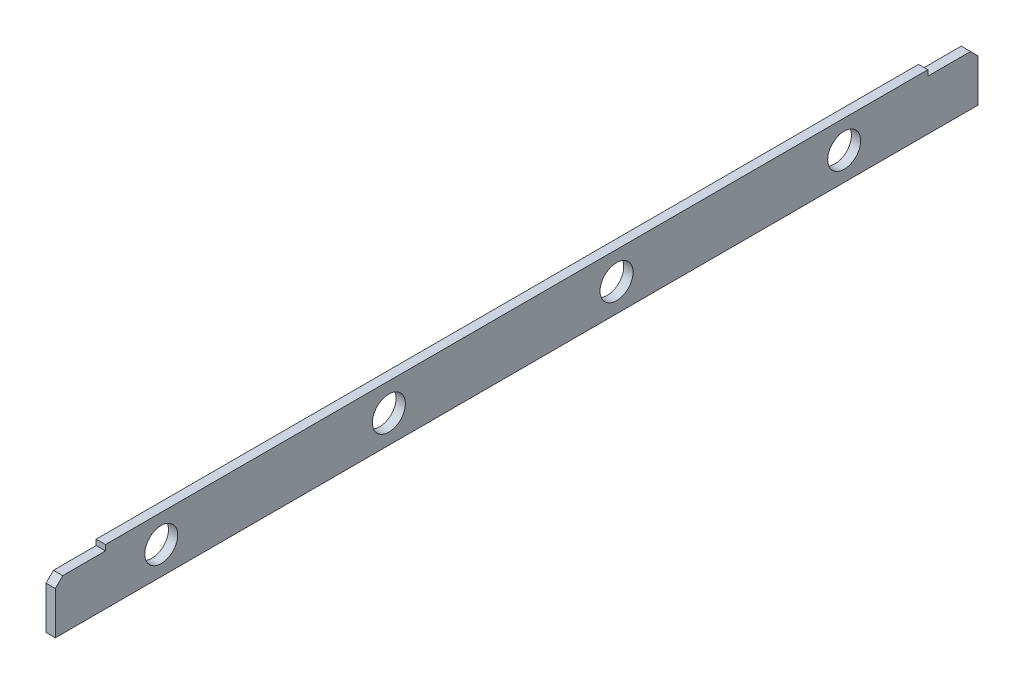
ISO-10303-21;
HEADER;
FILE_DESCRIPTION(('STEP AP214'),'2;1');
FILE_NAME('part.step','',(''),(''),'','','');
FILE_SCHEMA(('AUTOMOTIVE_DESIGN { 1 0 10303 214 1 1 1 1 }'));
ENDSEC;
DATA;
#1=APPLICATION_CONTEXT('core data for automotive mechanical design processes');
#2=APPLICATION_PROTOCOL_DEFINITION('international standard','automotive_design',2000,#1);
#3=PRODUCT_CONTEXT('',#1,'mechanical');
#4=PRODUCT('Part','Part','',(#3));
#5=PRODUCT_RELATED_PRODUCT_CATEGORY('part','',(#4));
#6=PRODUCT_DEFINITION_FORMATION('','',#4);
#7=PRODUCT_DEFINITION_CONTEXT('part definition',#1,'design');
#8=PRODUCT_DEFINITION('design','',#6,#7);
#9=PRODUCT_DEFINITION_SHAPE('','',#8);
#10=(LENGTH_UNIT() NAMED_UNIT(*) SI_UNIT(.MILLI.,.METRE.));
#11=(NAMED_UNIT(*) PLANE_ANGLE_UNIT() SI_UNIT($,.RADIAN.));
#12=(NAMED_UNIT(*) SI_UNIT($,.STERADIAN.) SOLID_ANGLE_UNIT());
#13=UNCERTAINTY_MEASURE_WITH_UNIT(LENGTH_MEASURE(1.E-05),#10,'distance_accuracy_value','');
#14=(GEOMETRIC_REPRESENTATION_CONTEXT(3) GLOBAL_UNCERTAINTY_ASSIGNED_CONTEXT((#13)) GLOBAL_UNIT_ASSIGNED_CONTEXT((#10,
#11,#12)) REPRESENTATION_CONTEXT('',''));
#15=CARTESIAN_POINT('',(0.,0.,0.));
#16=DIRECTION('',(0.,0.,1.));
#17=DIRECTION('',(1.,0.,0.));
#18=AXIS2_PLACEMENT_3D('',#15,#16,#17);
#19=CARTESIAN_POINT('',(-4.99999999999989,-60.000000000001,502.499999999999));
#20=DIRECTION('',(1.,0.,0.));
#21=DIRECTION('',(0.,0.,-1.));
#22=AXIS2_PLACEMENT_3D('',#19,#20,#21);
#23=PLANE('',#22);
#24=CARTESIAN_POINT('',(-4.99999999999989,-30.0000000000042,382.5));
#25=DIRECTION('',(1.,0.,0.));
#26=DIRECTION('',(0.,0.,-1.));
#27=AXIS2_PLACEMENT_3D('',#24,#25,#26);
#28=CIRCLE('',#27,17.75);
#29=CARTESIAN_POINT('',(-4.9999999999999,-30.0000000000042,364.75));
#30=VERTEX_POINT('',#29);
#31=EDGE_CURVE('E166',#30,#30,#28,.T.);
#32=ORIENTED_EDGE('',*,*,#31,.T.);
#33=EDGE_LOOP('',(#32));
#34=FACE_BOUND('',#33,.T.);
#35=CARTESIAN_POINT('',(-4.99999999999989,-30.0000000000042,137.5));
#36=DIRECTION('',(1.,0.,0.));
#37=DIRECTION('',(0.,0.,-1.));
#38=AXIS2_PLACEMENT_3D('',#35,#36,#37);
#39=CIRCLE('',#38,17.75);
#40=CARTESIAN_POINT('',(-4.9999999999999,-30.0000000000042,119.75));
#41=VERTEX_POINT('',#40);
#42=EDGE_CURVE('E163',#41,#41,#39,.T.);
#43=ORIENTED_EDGE('',*,*,#42,.T.);
#44=EDGE_LOOP('',(#43));
#45=FACE_BOUND('',#44,.T.);
#46=CARTESIAN_POINT('',(-5.,-30.0000000000042,-107.5));
#47=DIRECTION('',(1.,0.,0.));
#48=DIRECTION('',(0.,0.,-1.));
#49=AXIS2_PLACEMENT_3D('',#46,#47,#48);
#50=CIRCLE('',#49,17.75);
#51=CARTESIAN_POINT('',(-5.00000000000001,-30.0000000000042,-125.25));
#52=VERTEX_POINT('',#51);
#53=EDGE_CURVE('E160',#52,#52,#50,.T.);
#54=ORIENTED_EDGE('',*,*,#53,.T.);
#55=EDGE_LOOP('',(#54));
#56=FACE_BOUND('',#55,.T.);
#57=CARTESIAN_POINT('',(-5.,-30.0000000000042,-352.5));
#58=DIRECTION('',(1.,0.,0.));
#59=DIRECTION('',(0.,0.,-1.));
#60=AXIS2_PLACEMENT_3D('',#57,#58,#59);
#61=CIRCLE('',#60,17.75);
#62=CARTESIAN_POINT('',(-5.00000000000001,-30.0000000000042,-370.25));
#63=VERTEX_POINT('',#62);
#64=EDGE_CURVE('E159',#63,#63,#61,.T.);
#65=ORIENTED_EDGE('',*,*,#64,.T.);
#66=EDGE_LOOP('',(#65));
#67=FACE_BOUND('',#66,.T.);
#68=DIRECTION('',(0.,1.,0.));
#69=VECTOR('',#68,1.);
#70=CARTESIAN_POINT('',(-5.,-60.0000000000115,-496.5));
#71=LINE('',#70,#69);
#72=CARTESIAN_POINT('',(-5.00000000000334,-59.9999999999996,-496.5));
#73=VERTEX_POINT('',#72);
#74=CARTESIAN_POINT('',(-5.,-13.9999999999999,-496.5));
#75=VERTEX_POINT('',#74);
#76=EDGE_CURVE('E121',#73,#75,#71,.T.);
#77=ORIENTED_EDGE('',*,*,#76,.F.);
#78=DIRECTION('',(0.,0.,-1.));
#79=VECTOR('',#78,1.);
#80=CARTESIAN_POINT('',(-4.99999999999989,-60.000000000001,502.499999999999));
#81=LINE('',#80,#79);
#82=CARTESIAN_POINT('',(-4.99999999999989,-60.0000000000001,496.5));
#83=VERTEX_POINT('',#82);
#84=EDGE_CURVE('E144',#83,#73,#81,.T.);
#85=ORIENTED_EDGE('',*,*,#84,.F.);
#86=DIRECTION('',(0.,-1.,0.));
#87=VECTOR('',#86,1.);
#88=CARTESIAN_POINT('',(-4.99999999999989,-60.0000000000011,496.5));
#89=LINE('',#88,#87);
#90=CARTESIAN_POINT('',(-4.99999999999989,-14.,496.5));
#91=VERTEX_POINT('',#90);
#92=EDGE_CURVE('E183',#91,#83,#89,.T.);
#93=ORIENTED_EDGE('',*,*,#92,.F.);
#94=DIRECTION('',(0.,0.70710678118654,-0.707106781186555));
#95=VECTOR('',#94,1.);
#96=CARTESIAN_POINT('',(-4.99999999999989,-39.9999999999999,522.5));
#97=LINE('',#96,#95);
#98=CARTESIAN_POINT('',(-4.99999999999989,-6.0000000000001,488.499999999999));
#99=VERTEX_POINT('',#98);
#100=EDGE_CURVE('E152',#91,#99,#97,.T.);
#101=ORIENTED_EDGE('',*,*,#100,.T.);
#102=DIRECTION('',(0.,0.,1.));
#103=VECTOR('',#102,1.);
#104=CARTESIAN_POINT('',(-4.99999999999989,-6.,502.499999999999));
#105=LINE('',#104,#103);
#106=CARTESIAN_POINT('',(-4.99999999999989,-6.00000000000042,442.5));
#107=VERTEX_POINT('',#106);
#108=EDGE_CURVE('E189',#107,#99,#105,.T.);
#109=ORIENTED_EDGE('',*,*,#108,.F.);
#110=DIRECTION('',(0.,-1.,0.));
#111=VECTOR('',#110,1.);
#112=CARTESIAN_POINT('',(-4.9999999999999,-60.0000000000044,442.500000000003));
#113=LINE('',#112,#111);
#114=CARTESIAN_POINT('',(-4.9999999999999,0.,442.5));
#115=VERTEX_POINT('',#114);
#116=EDGE_CURVE('E192',#115,#107,#113,.T.);
#117=ORIENTED_EDGE('',*,*,#116,.F.);
#118=DIRECTION('',(0.,0.,-1.));
#119=VECTOR('',#118,1.);
#120=CARTESIAN_POINT('',(-4.99999999999989,0.,502.499999999999));
#121=LINE('',#120,#119);
#122=CARTESIAN_POINT('',(-5.00000000000334,6.66133814775094E-13,-442.500000000001));
#123=VERTEX_POINT('',#122);
#124=EDGE_CURVE('E148',#115,#123,#121,.T.);
#125=ORIENTED_EDGE('',*,*,#124,.T.);
#126=DIRECTION('',(0.,1.,0.));
#127=VECTOR('',#126,1.);
#128=CARTESIAN_POINT('',(-5.,-60.0000000000109,-442.5));
#129=LINE('',#128,#127);
#130=CARTESIAN_POINT('',(-5.,-5.99999999999934,-442.5));
#131=VERTEX_POINT('',#130);
#132=EDGE_CURVE('E142',#131,#123,#129,.T.);
#133=ORIENTED_EDGE('',*,*,#132,.F.);
#134=DIRECTION('',(0.,0.,1.));
#135=VECTOR('',#134,1.);
#136=CARTESIAN_POINT('',(-4.99999999999989,-5.9999999999885,502.499999999999));
#137=LINE('',#136,#135);
#138=CARTESIAN_POINT('',(-5.,-5.99999999999978,-488.500000000001));
#139=VERTEX_POINT('',#138);
#140=EDGE_CURVE('E133',#139,#131,#137,.T.);
#141=ORIENTED_EDGE('',*,*,#140,.F.);
#142=DIRECTION('',(0.,-0.707106781186558,-0.707106781186537));
#143=VECTOR('',#142,1.);
#144=CARTESIAN_POINT('',(-4.99999999999995,462.499999999999,-20.0000000000157));
#145=LINE('',#144,#143);
#146=EDGE_CURVE('E151',#139,#75,#145,.T.);
#147=ORIENTED_EDGE('',*,*,#146,.T.);
#148=EDGE_LOOP('',(#77,#85,#93,#101,#109,#117,#125,#133,#141,#147));
#149=FACE_BOUND('',#148,.T.);
#150=ADVANCED_FACE('F34',(#34,#45,#56,#67,#149),#23,.F.);
#151=CARTESIAN_POINT('',(-4.99999999999989,0.,502.499999999999));
#152=DIRECTION('',(0.,-1.,0.));
#153=DIRECTION('',(0.,0.,-1.));
#154=AXIS2_PLACEMENT_3D('',#151,#152,#153);
#155=PLANE('',#154);
#156=DIRECTION('',(1.,0.,0.));
#157=VECTOR('',#156,1.);
#158=CARTESIAN_POINT('',(-600.,6.66133814775094E-13,-442.5));
#159=LINE('',#158,#157);
#160=CARTESIAN_POINT('',(5.,6.66133814775094E-13,-442.500000000001));
#161=VERTEX_POINT('',#160);
#162=EDGE_CURVE('E139',#123,#161,#159,.T.);
#163=ORIENTED_EDGE('',*,*,#162,.F.);
#164=ORIENTED_EDGE('',*,*,#124,.F.);
#165=DIRECTION('',(1.,0.,0.));
#166=VECTOR('',#165,1.);
#167=CARTESIAN_POINT('',(-600.,-4.18977760661176E-13,442.499999999999));
#168=LINE('',#167,#166);
#169=CARTESIAN_POINT('',(5.00000000000067,-4.18977760661176E-13,442.499999999999));
#170=VERTEX_POINT('',#169);
#171=EDGE_CURVE('E147',#115,#170,#168,.T.);
#172=ORIENTED_EDGE('',*,*,#171,.T.);
#173=DIRECTION('',(0.,0.,-1.));
#174=VECTOR('',#173,1.);
#175=CARTESIAN_POINT('',(5.00000000000012,0.,502.499999999999));
#176=LINE('',#175,#174);
#177=EDGE_CURVE('E118',#170,#161,#176,.T.);
#178=ORIENTED_EDGE('',*,*,#177,.T.);
#179=EDGE_LOOP('',(#163,#164,#172,#178));
#180=FACE_BOUND('',#179,.T.);
#181=ADVANCED_FACE('F221',(#180),#155,.F.);
#182=CARTESIAN_POINT('',(5.00000000000012,-60.000000000001,502.499999999999));
#183=DIRECTION('',(-1.,0.,0.));
#184=DIRECTION('',(0.,0.,1.));
#185=AXIS2_PLACEMENT_3D('',#182,#183,#184);
#186=PLANE('',#185);
#187=CARTESIAN_POINT('',(5.00000000000012,-30.0000000000042,382.5));
#188=DIRECTION('',(-1.,0.,0.));
#189=DIRECTION('',(0.,0.,1.));
#190=AXIS2_PLACEMENT_3D('',#187,#188,#189);
#191=CIRCLE('',#190,17.75);
#192=CARTESIAN_POINT('',(5.00000000000012,-30.0000000000042,400.25));
#193=VERTEX_POINT('',#192);
#194=EDGE_CURVE('E37',#193,#193,#191,.T.);
#195=ORIENTED_EDGE('',*,*,#194,.T.);
#196=EDGE_LOOP('',(#195));
#197=FACE_BOUND('',#196,.T.);
#198=CARTESIAN_POINT('',(5.00000000000012,-30.0000000000042,137.5));
#199=DIRECTION('',(-1.,0.,0.));
#200=DIRECTION('',(0.,0.,1.));
#201=AXIS2_PLACEMENT_3D('',#198,#199,#200);
#202=CIRCLE('',#201,17.75);
#203=CARTESIAN_POINT('',(5.00000000000012,-30.0000000000042,155.25));
#204=VERTEX_POINT('',#203);
#205=EDGE_CURVE('E164',#204,#204,#202,.T.);
#206=ORIENTED_EDGE('',*,*,#205,.T.);
#207=EDGE_LOOP('',(#206));
#208=FACE_BOUND('',#207,.T.);
#209=CARTESIAN_POINT('',(5.,-30.0000000000042,-107.5));
#210=DIRECTION('',(-1.,0.,0.));
#211=DIRECTION('',(0.,0.,1.));
#212=AXIS2_PLACEMENT_3D('',#209,#210,#211);
#213=CIRCLE('',#212,17.75);
#214=CARTESIAN_POINT('',(5.00000000000001,-30.0000000000042,-89.7500000000002));
#215=VERTEX_POINT('',#214);
#216=EDGE_CURVE('E161',#215,#215,#213,.T.);
#217=ORIENTED_EDGE('',*,*,#216,.T.);
#218=EDGE_LOOP('',(#217));
#219=FACE_BOUND('',#218,.T.);
#220=CARTESIAN_POINT('',(5.,-30.0000000000042,-352.5));
#221=DIRECTION('',(-1.,0.,0.));
#222=DIRECTION('',(0.,0.,1.));
#223=AXIS2_PLACEMENT_3D('',#220,#221,#222);
#224=CIRCLE('',#223,17.75);
#225=CARTESIAN_POINT('',(5.00000000000001,-30.0000000000042,-334.75));
#226=VERTEX_POINT('',#225);
#227=EDGE_CURVE('E156',#226,#226,#224,.T.);
#228=ORIENTED_EDGE('',*,*,#227,.T.);
#229=EDGE_LOOP('',(#228));
#230=FACE_BOUND('',#229,.T.);
#231=DIRECTION('',(0.,-1.,0.));
#232=VECTOR('',#231,1.);
#233=CARTESIAN_POINT('',(5.00000000000001,-60.0000000000115,-496.5));
#234=LINE('',#233,#232);
#235=CARTESIAN_POINT('',(5.,-13.9999999999999,-496.5));
#236=VERTEX_POINT('',#235);
#237=CARTESIAN_POINT('',(5.00000000000001,-60.000000000001,-496.5));
#238=VERTEX_POINT('',#237);
#239=EDGE_CURVE('E42',#236,#238,#234,.T.);
#240=ORIENTED_EDGE('',*,*,#239,.F.);
#241=DIRECTION('',(0.,0.707106781186558,0.707106781186537));
#242=VECTOR('',#241,1.);
#243=CARTESIAN_POINT('',(5.00000000000006,462.499999999999,-20.0000000000157));
#244=LINE('',#243,#242);
#245=CARTESIAN_POINT('',(5.,-5.99999999999978,-488.500000000001));
#246=VERTEX_POINT('',#245);
#247=EDGE_CURVE('E109',#236,#246,#244,.T.);
#248=ORIENTED_EDGE('',*,*,#247,.T.);
#249=DIRECTION('',(0.,0.,-1.));
#250=VECTOR('',#249,1.);
#251=CARTESIAN_POINT('',(5.00000000000012,-5.9999999999885,502.499999999999));
#252=LINE('',#251,#250);
#253=CARTESIAN_POINT('',(5.,-5.99999999999934,-442.5));
#254=VERTEX_POINT('',#253);
#255=EDGE_CURVE('E138',#254,#246,#252,.T.);
#256=ORIENTED_EDGE('',*,*,#255,.F.);
#257=DIRECTION('',(0.,-1.,0.));
#258=VECTOR('',#257,1.);
#259=CARTESIAN_POINT('',(5.00000000000001,-60.0000000000109,-442.5));
#260=LINE('',#259,#258);
#261=EDGE_CURVE('E141',#161,#254,#260,.T.);
#262=ORIENTED_EDGE('',*,*,#261,.F.);
#263=ORIENTED_EDGE('',*,*,#177,.F.);
#264=DIRECTION('',(0.,1.,0.));
#265=VECTOR('',#264,1.);
#266=CARTESIAN_POINT('',(5.00000000000011,-60.0000000000044,442.500000000003));
#267=LINE('',#266,#265);
#268=CARTESIAN_POINT('',(5.00000000000012,-6.00000000000042,442.5));
#269=VERTEX_POINT('',#268);
#270=EDGE_CURVE('E155',#269,#170,#267,.T.);
#271=ORIENTED_EDGE('',*,*,#270,.F.);
#272=DIRECTION('',(0.,0.,-1.));
#273=VECTOR('',#272,1.);
#274=CARTESIAN_POINT('',(5.00000000000012,-6.,502.499999999999));
#275=LINE('',#274,#273);
#276=CARTESIAN_POINT('',(5.00000000000012,-6.0000000000001,488.499999999999));
#277=VERTEX_POINT('',#276);
#278=EDGE_CURVE('E191',#277,#269,#275,.T.);
#279=ORIENTED_EDGE('',*,*,#278,.F.);
#280=DIRECTION('',(0.,-0.70710678118654,0.707106781186555));
#281=VECTOR('',#280,1.);
#282=CARTESIAN_POINT('',(5.00000000000012,-39.9999999999999,522.5));
#283=LINE('',#282,#281);
#284=CARTESIAN_POINT('',(5.00000000000012,-14.,496.5));
#285=VERTEX_POINT('',#284);
#286=EDGE_CURVE('E117',#277,#285,#283,.T.);
#287=ORIENTED_EDGE('',*,*,#286,.T.);
#288=DIRECTION('',(0.,1.,0.));
#289=VECTOR('',#288,1.);
#290=CARTESIAN_POINT('',(5.00000000000011,-60.0000000000011,496.5));
#291=LINE('',#290,#289);
#292=CARTESIAN_POINT('',(5.00000000000012,-60.0000000000001,496.5));
#293=VERTEX_POINT('',#292);
#294=EDGE_CURVE('E186',#293,#285,#291,.T.);
#295=ORIENTED_EDGE('',*,*,#294,.F.);
#296=DIRECTION('',(0.,0.,-1.));
#297=VECTOR('',#296,1.);
#298=CARTESIAN_POINT('',(5.00000000000012,-60.000000000001,502.499999999999));
#299=LINE('',#298,#297);
#300=EDGE_CURVE('E127',#293,#238,#299,.T.);
#301=ORIENTED_EDGE('',*,*,#300,.T.);
#302=EDGE_LOOP('',(#240,#248,#256,#262,#263,#271,#279,#287,#295,#301));
#303=FACE_BOUND('',#302,.T.);
#304=ADVANCED_FACE('F124',(#197,#208,#219,#230,#303),#186,.F.);
#305=CARTESIAN_POINT('',(5.00000000000012,-60.000000000001,502.499999999999));
#306=DIRECTION('',(0.,1.,0.));
#307=DIRECTION('',(0.,0.,1.));
#308=AXIS2_PLACEMENT_3D('',#305,#306,#307);
#309=PLANE('',#308);
#310=DIRECTION('',(-1.,0.,0.));
#311=VECTOR('',#310,1.);
#312=CARTESIAN_POINT('',(4.99999999999984,-60.000000000001,-496.5));
#313=LINE('',#312,#311);
#314=EDGE_CURVE('E11',#238,#73,#313,.T.);
#315=ORIENTED_EDGE('',*,*,#314,.F.);
#316=ORIENTED_EDGE('',*,*,#300,.F.);
#317=DIRECTION('',(1.,0.,0.));
#318=VECTOR('',#317,1.);
#319=CARTESIAN_POINT('',(-600.,-60.0000000000001,496.5));
#320=LINE('',#319,#318);
#321=EDGE_CURVE('E185',#83,#293,#320,.T.);
#322=ORIENTED_EDGE('',*,*,#321,.F.);
#323=ORIENTED_EDGE('',*,*,#84,.T.);
#324=EDGE_LOOP('',(#315,#316,#322,#323));
#325=FACE_BOUND('',#324,.T.);
#326=ADVANCED_FACE('F239',(#325),#309,.F.);
#327=CARTESIAN_POINT('',(-600.,-2.00000000000042,442.5));
#328=DIRECTION('',(0.,0.,1.));
#329=DIRECTION('',(0.,-1.,0.));
#330=AXIS2_PLACEMENT_3D('',#327,#328,#329);
#331=PLANE('',#330);
#332=ORIENTED_EDGE('',*,*,#270,.T.);
#333=ORIENTED_EDGE('',*,*,#171,.F.);
#334=ORIENTED_EDGE('',*,*,#116,.T.);
#335=DIRECTION('',(1.,0.,0.));
#336=VECTOR('',#335,1.);
#337=CARTESIAN_POINT('',(-600.,-6.00000000000042,442.5));
#338=LINE('',#337,#336);
#339=EDGE_CURVE('E194',#107,#269,#338,.T.);
#340=ORIENTED_EDGE('',*,*,#339,.T.);
#341=EDGE_LOOP('',(#332,#333,#334,#340));
#342=FACE_BOUND('',#341,.T.);
#343=ADVANCED_FACE('F227',(#342),#331,.T.);
#344=CARTESIAN_POINT('',(-600.,-56.0000000000001,496.5));
#345=DIRECTION('',(0.,0.,1.));
#346=DIRECTION('',(0.,-1.,0.));
#347=AXIS2_PLACEMENT_3D('',#344,#345,#346);
#348=PLANE('',#347);
#349=ORIENTED_EDGE('',*,*,#294,.T.);
#350=DIRECTION('',(1.,0.,0.));
#351=VECTOR('',#350,1.);
#352=CARTESIAN_POINT('',(-600.,-14.,496.5));
#353=LINE('',#352,#351);
#354=EDGE_CURVE('E196',#91,#285,#353,.T.);
#355=ORIENTED_EDGE('',*,*,#354,.F.);
#356=ORIENTED_EDGE('',*,*,#92,.T.);
#357=ORIENTED_EDGE('',*,*,#321,.T.);
#358=EDGE_LOOP('',(#349,#355,#356,#357));
#359=FACE_BOUND('',#358,.T.);
#360=ADVANCED_FACE('F241',(#359),#348,.T.);
#361=CARTESIAN_POINT('',(-600.,-14.,496.5));
#362=DIRECTION('',(0.,-0.707106781186555,-0.70710678118654));
#363=DIRECTION('',(0.,0.70710678118654,-0.707106781186555));
#364=AXIS2_PLACEMENT_3D('',#361,#362,#363);
#365=PLANE('',#364);
#366=DIRECTION('',(1.,0.,0.));
#367=VECTOR('',#366,1.);
#368=CARTESIAN_POINT('',(-600.,-6.0000000000001,488.499999999999));
#369=LINE('',#368,#367);
#370=EDGE_CURVE('E134',#99,#277,#369,.T.);
#371=ORIENTED_EDGE('',*,*,#370,.F.);
#372=ORIENTED_EDGE('',*,*,#100,.F.);
#373=ORIENTED_EDGE('',*,*,#354,.T.);
#374=ORIENTED_EDGE('',*,*,#286,.F.);
#375=EDGE_LOOP('',(#371,#372,#373,#374));
#376=FACE_BOUND('',#375,.T.);
#377=ADVANCED_FACE('F244',(#376),#365,.F.);
#378=CARTESIAN_POINT('',(-600.,-6.0000000000001,488.499999999999));
#379=DIRECTION('',(0.,1.,0.));
#380=DIRECTION('',(0.,0.,1.));
#381=AXIS2_PLACEMENT_3D('',#378,#379,#380);
#382=PLANE('',#381);
#383=ORIENTED_EDGE('',*,*,#278,.T.);
#384=ORIENTED_EDGE('',*,*,#339,.F.);
#385=ORIENTED_EDGE('',*,*,#108,.T.);
#386=ORIENTED_EDGE('',*,*,#370,.T.);
#387=EDGE_LOOP('',(#383,#384,#385,#386));
#388=FACE_BOUND('',#387,.T.);
#389=ADVANCED_FACE('F230',(#388),#382,.T.);
#390=CARTESIAN_POINT('',(-600.,-5.99999999999978,-488.5));
#391=DIRECTION('',(0.,-0.707106781186537,0.707106781186558));
#392=DIRECTION('',(0.,-0.707106781186558,-0.707106781186537));
#393=AXIS2_PLACEMENT_3D('',#390,#391,#392);
#394=PLANE('',#393);
#395=DIRECTION('',(1.,0.,0.));
#396=VECTOR('',#395,1.);
#397=CARTESIAN_POINT('',(-600.,-5.99999999999978,-488.5));
#398=LINE('',#397,#396);
#399=EDGE_CURVE('E114',#139,#246,#398,.T.);
#400=ORIENTED_EDGE('',*,*,#399,.T.);
#401=ORIENTED_EDGE('',*,*,#247,.F.);
#402=DIRECTION('',(1.,0.,0.));
#403=VECTOR('',#402,1.);
#404=CARTESIAN_POINT('',(-600.,-13.9999999999999,-496.5));
#405=LINE('',#404,#403);
#406=EDGE_CURVE('E111',#75,#236,#405,.T.);
#407=ORIENTED_EDGE('',*,*,#406,.F.);
#408=ORIENTED_EDGE('',*,*,#146,.F.);
#409=EDGE_LOOP('',(#400,#401,#407,#408));
#410=FACE_BOUND('',#409,.T.);
#411=ADVANCED_FACE('F110',(#410),#394,.F.);
#412=CARTESIAN_POINT('',(-600.,-5.99999999999934,-446.5));
#413=DIRECTION('',(0.,1.,0.));
#414=DIRECTION('',(0.,0.,1.));
#415=AXIS2_PLACEMENT_3D('',#412,#413,#414);
#416=PLANE('',#415);
#417=ORIENTED_EDGE('',*,*,#140,.T.);
#418=DIRECTION('',(1.,0.,0.));
#419=VECTOR('',#418,1.);
#420=CARTESIAN_POINT('',(-600.,-5.99999999999934,-442.5));
#421=LINE('',#420,#419);
#422=EDGE_CURVE('E135',#131,#254,#421,.T.);
#423=ORIENTED_EDGE('',*,*,#422,.T.);
#424=ORIENTED_EDGE('',*,*,#255,.T.);
#425=ORIENTED_EDGE('',*,*,#399,.F.);
#426=EDGE_LOOP('',(#417,#423,#424,#425));
#427=FACE_BOUND('',#426,.T.);
#428=ADVANCED_FACE('F234',(#427),#416,.T.);
#429=CARTESIAN_POINT('',(-600.,6.66133814775094E-13,-442.5));
#430=DIRECTION('',(0.,0.,-1.));
#431=DIRECTION('',(0.,1.,0.));
#432=AXIS2_PLACEMENT_3D('',#429,#430,#431);
#433=PLANE('',#432);
#434=ORIENTED_EDGE('',*,*,#132,.T.);
#435=ORIENTED_EDGE('',*,*,#162,.T.);
#436=ORIENTED_EDGE('',*,*,#261,.T.);
#437=ORIENTED_EDGE('',*,*,#422,.F.);
#438=EDGE_LOOP('',(#434,#435,#436,#437));
#439=FACE_BOUND('',#438,.T.);
#440=ADVANCED_FACE('F215',(#439),#433,.T.);
#441=CARTESIAN_POINT('',(-600.,-13.9999999999999,-496.5));
#442=DIRECTION('',(0.,0.,-1.));
#443=DIRECTION('',(0.,1.,0.));
#444=AXIS2_PLACEMENT_3D('',#441,#442,#443);
#445=PLANE('',#444);
#446=ORIENTED_EDGE('',*,*,#76,.T.);
#447=ORIENTED_EDGE('',*,*,#406,.T.);
#448=ORIENTED_EDGE('',*,*,#239,.T.);
#449=ORIENTED_EDGE('',*,*,#314,.T.);
#450=EDGE_LOOP('',(#446,#447,#448,#449));
#451=FACE_BOUND('',#450,.T.);
#452=ADVANCED_FACE('F120',(#451),#445,.T.);
#453=CARTESIAN_POINT('',(610.,-30.0000000000042,-352.5));
#454=DIRECTION('',(-1.,0.,0.));
#455=DIRECTION('',(0.,0.,1.));
#456=AXIS2_PLACEMENT_3D('',#453,#454,#455);
#457=CYLINDRICAL_SURFACE('',#456,17.75);
#458=ORIENTED_EDGE('',*,*,#227,.F.);
#459=EDGE_LOOP('',(#458));
#460=FACE_BOUND('',#459,.T.);
#461=ORIENTED_EDGE('',*,*,#64,.F.);
#462=EDGE_LOOP('',(#461));
#463=FACE_BOUND('',#462,.T.);
#464=ADVANCED_FACE('F264',(#460,#463),#457,.F.);
#465=CARTESIAN_POINT('',(610.,-30.0000000000042,-107.5));
#466=DIRECTION('',(-1.,0.,0.));
#467=DIRECTION('',(0.,0.,1.));
#468=AXIS2_PLACEMENT_3D('',#465,#466,#467);
#469=CYLINDRICAL_SURFACE('',#468,17.75);
#470=ORIENTED_EDGE('',*,*,#216,.F.);
#471=EDGE_LOOP('',(#470));
#472=FACE_BOUND('',#471,.T.);
#473=ORIENTED_EDGE('',*,*,#53,.F.);
#474=EDGE_LOOP('',(#473));
#475=FACE_BOUND('',#474,.T.);
#476=ADVANCED_FACE('F266',(#472,#475),#469,.F.);
#477=CARTESIAN_POINT('',(610.,-30.0000000000042,137.5));
#478=DIRECTION('',(-1.,0.,0.));
#479=DIRECTION('',(0.,0.,1.));
#480=AXIS2_PLACEMENT_3D('',#477,#478,#479);
#481=CYLINDRICAL_SURFACE('',#480,17.75);
#482=ORIENTED_EDGE('',*,*,#205,.F.);
#483=EDGE_LOOP('',(#482));
#484=FACE_BOUND('',#483,.T.);
#485=ORIENTED_EDGE('',*,*,#42,.F.);
#486=EDGE_LOOP('',(#485));
#487=FACE_BOUND('',#486,.T.);
#488=ADVANCED_FACE('F273',(#484,#487),#481,.F.);
#489=CARTESIAN_POINT('',(610.,-30.0000000000042,382.499999999999));
#490=DIRECTION('',(-1.,0.,0.));
#491=DIRECTION('',(0.,0.,1.));
#492=AXIS2_PLACEMENT_3D('',#489,#490,#491);
#493=CYLINDRICAL_SURFACE('',#492,17.75);
#494=ORIENTED_EDGE('',*,*,#194,.F.);
#495=EDGE_LOOP('',(#494));
#496=FACE_BOUND('',#495,.T.);
#497=ORIENTED_EDGE('',*,*,#31,.F.);
#498=EDGE_LOOP('',(#497));
#499=FACE_BOUND('',#498,.T.);
#500=ADVANCED_FACE('F281',(#496,#499),#493,.F.);
#501=CLOSED_SHELL('',(#150,#181,#304,#326,#343,#360,#377,#389,#411,#428,#440,#452,#464,#476,
#488,#500));
#502=MANIFOLD_SOLID_BREP('B2',#501);
#503=ADVANCED_BREP_SHAPE_REPRESENTATION('',(#18,#502),#14);
#504=SHAPE_DEFINITION_REPRESENTATION(#9,#503);
ENDSEC;
END-ISO-10303-21;
